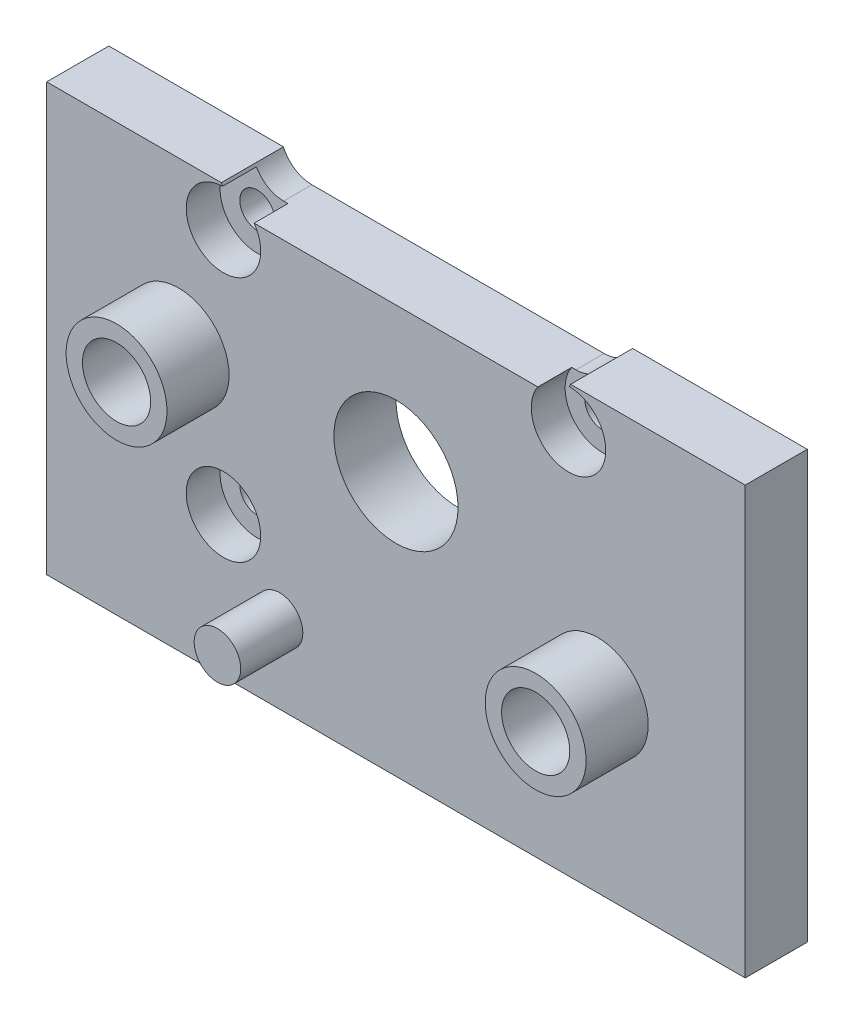
ISO-10303-21;
HEADER;
FILE_DESCRIPTION(('STEP AP214'),'2;1');
FILE_NAME('part.step','',(''),(''),'','','');
FILE_SCHEMA(('AUTOMOTIVE_DESIGN { 1 0 10303 214 1 1 1 1 }'));
ENDSEC;
DATA;
#1=APPLICATION_CONTEXT('core data for automotive mechanical design processes');
#2=APPLICATION_PROTOCOL_DEFINITION('international standard','automotive_design',2000,#1);
#3=PRODUCT_CONTEXT('',#1,'mechanical');
#4=PRODUCT('Part','Part','',(#3));
#5=PRODUCT_RELATED_PRODUCT_CATEGORY('part','',(#4));
#6=PRODUCT_DEFINITION_FORMATION('','',#4);
#7=PRODUCT_DEFINITION_CONTEXT('part definition',#1,'design');
#8=PRODUCT_DEFINITION('design','',#6,#7);
#9=PRODUCT_DEFINITION_SHAPE('','',#8);
#10=(LENGTH_UNIT() NAMED_UNIT(*) SI_UNIT(.MILLI.,.METRE.));
#11=(NAMED_UNIT(*) PLANE_ANGLE_UNIT() SI_UNIT($,.RADIAN.));
#12=(NAMED_UNIT(*) SI_UNIT($,.STERADIAN.) SOLID_ANGLE_UNIT());
#13=UNCERTAINTY_MEASURE_WITH_UNIT(LENGTH_MEASURE(1.E-05),#10,'distance_accuracy_value','');
#14=(GEOMETRIC_REPRESENTATION_CONTEXT(3) GLOBAL_UNCERTAINTY_ASSIGNED_CONTEXT((#13)) GLOBAL_UNIT_ASSIGNED_CONTEXT((#10,
#11,#12)) REPRESENTATION_CONTEXT('',''));
#15=CARTESIAN_POINT('',(0.,0.,0.));
#16=DIRECTION('',(0.,0.,1.));
#17=DIRECTION('',(1.,0.,0.));
#18=AXIS2_PLACEMENT_3D('',#15,#16,#17);
#19=CARTESIAN_POINT('',(22.5,10.5,0.));
#20=DIRECTION('',(0.,1.,0.));
#21=DIRECTION('',(0.,0.,1.));
#22=AXIS2_PLACEMENT_3D('',#19,#20,#21);
#23=PLANE('',#22);
#24=DIRECTION('',(0.,0.,-1.));
#25=VECTOR('',#24,1.);
#26=CARTESIAN_POINT('',(11.25,10.5,4.));
#27=LINE('',#26,#25);
#28=CARTESIAN_POINT('',(11.25,10.5,4.));
#29=VERTEX_POINT('',#28);
#30=CARTESIAN_POINT('',(11.25,10.5,0.));
#31=VERTEX_POINT('',#30);
#32=EDGE_CURVE('E148',#29,#31,#27,.T.);
#33=ORIENTED_EDGE('',*,*,#32,.F.);
#34=DIRECTION('',(-1.,0.,0.));
#35=VECTOR('',#34,1.);
#36=CARTESIAN_POINT('',(22.5,10.5,4.));
#37=LINE('',#36,#35);
#38=CARTESIAN_POINT('',(22.5,10.5,4.));
#39=VERTEX_POINT('',#38);
#40=EDGE_CURVE('E173',#39,#29,#37,.T.);
#41=ORIENTED_EDGE('',*,*,#40,.F.);
#42=DIRECTION('',(0.,0.,1.));
#43=VECTOR('',#42,1.);
#44=CARTESIAN_POINT('',(22.5,10.5,0.));
#45=LINE('',#44,#43);
#46=CARTESIAN_POINT('',(22.5,10.5,0.));
#47=VERTEX_POINT('',#46);
#48=EDGE_CURVE('E168',#47,#39,#45,.T.);
#49=ORIENTED_EDGE('',*,*,#48,.F.);
#50=DIRECTION('',(-1.,0.,0.));
#51=VECTOR('',#50,1.);
#52=CARTESIAN_POINT('',(22.5,10.5,0.));
#53=LINE('',#52,#51);
#54=EDGE_CURVE('E159',#47,#31,#53,.T.);
#55=ORIENTED_EDGE('',*,*,#54,.T.);
#56=EDGE_LOOP('',(#33,#41,#49,#55));
#57=FACE_BOUND('',#56,.T.);
#58=ADVANCED_FACE('F35',(#57),#23,.T.);
#59=CARTESIAN_POINT('',(22.5,-17.,0.));
#60=DIRECTION('',(1.,0.,0.));
#61=DIRECTION('',(0.,0.,-1.));
#62=AXIS2_PLACEMENT_3D('',#59,#60,#61);
#63=PLANE('',#62);
#64=DIRECTION('',(0.,1.,0.));
#65=VECTOR('',#64,1.);
#66=CARTESIAN_POINT('',(22.5,-17.,4.));
#67=LINE('',#66,#65);
#68=CARTESIAN_POINT('',(22.5,-17.,4.));
#69=VERTEX_POINT('',#68);
#70=EDGE_CURVE('E169',#69,#39,#67,.T.);
#71=ORIENTED_EDGE('',*,*,#70,.F.);
#72=DIRECTION('',(0.,0.,1.));
#73=VECTOR('',#72,1.);
#74=CARTESIAN_POINT('',(22.5,-17.,0.));
#75=LINE('',#74,#73);
#76=CARTESIAN_POINT('',(22.5,-17.,0.));
#77=VERTEX_POINT('',#76);
#78=EDGE_CURVE('E181',#77,#69,#75,.T.);
#79=ORIENTED_EDGE('',*,*,#78,.F.);
#80=DIRECTION('',(0.,1.,0.));
#81=VECTOR('',#80,1.);
#82=CARTESIAN_POINT('',(22.5,-17.,0.));
#83=LINE('',#82,#81);
#84=EDGE_CURVE('E154',#77,#47,#83,.T.);
#85=ORIENTED_EDGE('',*,*,#84,.T.);
#86=ORIENTED_EDGE('',*,*,#48,.T.);
#87=EDGE_LOOP('',(#71,#79,#85,#86));
#88=FACE_BOUND('',#87,.T.);
#89=ADVANCED_FACE('F37',(#88),#63,.T.);
#90=CARTESIAN_POINT('',(-22.5,-17.,0.));
#91=DIRECTION('',(0.,-1.,0.));
#92=DIRECTION('',(0.,0.,-1.));
#93=AXIS2_PLACEMENT_3D('',#90,#91,#92);
#94=PLANE('',#93);
#95=DIRECTION('',(1.,0.,0.));
#96=VECTOR('',#95,1.);
#97=CARTESIAN_POINT('',(-22.5,-17.,4.));
#98=LINE('',#97,#96);
#99=CARTESIAN_POINT('',(-22.5,-17.,4.));
#100=VERTEX_POINT('',#99);
#101=EDGE_CURVE('E158',#100,#69,#98,.T.);
#102=ORIENTED_EDGE('',*,*,#101,.F.);
#103=DIRECTION('',(0.,0.,1.));
#104=VECTOR('',#103,1.);
#105=CARTESIAN_POINT('',(-22.5,-17.,0.));
#106=LINE('',#105,#104);
#107=CARTESIAN_POINT('',(-22.5,-17.,0.));
#108=VERTEX_POINT('',#107);
#109=EDGE_CURVE('E184',#108,#100,#106,.T.);
#110=ORIENTED_EDGE('',*,*,#109,.F.);
#111=DIRECTION('',(1.,0.,0.));
#112=VECTOR('',#111,1.);
#113=CARTESIAN_POINT('',(-22.5,-17.,0.));
#114=LINE('',#113,#112);
#115=EDGE_CURVE('E165',#108,#77,#114,.T.);
#116=ORIENTED_EDGE('',*,*,#115,.T.);
#117=ORIENTED_EDGE('',*,*,#78,.T.);
#118=EDGE_LOOP('',(#102,#110,#116,#117));
#119=FACE_BOUND('',#118,.T.);
#120=ADVANCED_FACE('F316',(#119),#94,.T.);
#121=CARTESIAN_POINT('',(-22.5,10.5,0.));
#122=DIRECTION('',(-1.,0.,0.));
#123=DIRECTION('',(0.,0.,1.));
#124=AXIS2_PLACEMENT_3D('',#121,#122,#123);
#125=PLANE('',#124);
#126=DIRECTION('',(0.,-1.,0.));
#127=VECTOR('',#126,1.);
#128=CARTESIAN_POINT('',(-22.5,10.5,4.));
#129=LINE('',#128,#127);
#130=CARTESIAN_POINT('',(-22.5,10.5,4.));
#131=VERTEX_POINT('',#130);
#132=EDGE_CURVE('E176',#131,#100,#129,.T.);
#133=ORIENTED_EDGE('',*,*,#132,.F.);
#134=DIRECTION('',(0.,0.,1.));
#135=VECTOR('',#134,1.);
#136=CARTESIAN_POINT('',(-22.5,10.5,0.));
#137=LINE('',#136,#135);
#138=CARTESIAN_POINT('',(-22.5,10.5,0.));
#139=VERTEX_POINT('',#138);
#140=EDGE_CURVE('E186',#139,#131,#137,.T.);
#141=ORIENTED_EDGE('',*,*,#140,.F.);
#142=DIRECTION('',(0.,-1.,0.));
#143=VECTOR('',#142,1.);
#144=CARTESIAN_POINT('',(-22.5,10.5,0.));
#145=LINE('',#144,#143);
#146=EDGE_CURVE('E162',#139,#108,#145,.T.);
#147=ORIENTED_EDGE('',*,*,#146,.T.);
#148=ORIENTED_EDGE('',*,*,#109,.T.);
#149=EDGE_LOOP('',(#133,#141,#147,#148));
#150=FACE_BOUND('',#149,.T.);
#151=ADVANCED_FACE('F320',(#150),#125,.T.);
#152=DIRECTION('',(0.,0.,-1.));
#153=VECTOR('',#152,1.);
#154=CARTESIAN_POINT('',(-11.25,10.5,4.));
#155=LINE('',#154,#153);
#156=CARTESIAN_POINT('',(-11.25,10.5,4.));
#157=VERTEX_POINT('',#156);
#158=CARTESIAN_POINT('',(-11.25,10.5,0.));
#159=VERTEX_POINT('',#158);
#160=EDGE_CURVE('E144',#157,#159,#155,.T.);
#161=ORIENTED_EDGE('',*,*,#160,.T.);
#162=EDGE_CURVE('E157',#159,#139,#53,.T.);
#163=ORIENTED_EDGE('',*,*,#162,.T.);
#164=ORIENTED_EDGE('',*,*,#140,.T.);
#165=EDGE_CURVE('E172',#157,#131,#37,.T.);
#166=ORIENTED_EDGE('',*,*,#165,.F.);
#167=EDGE_LOOP('',(#161,#163,#164,#166));
#168=FACE_BOUND('',#167,.T.);
#169=ADVANCED_FACE('F312',(#168),#23,.T.);
#170=CARTESIAN_POINT('',(0.,0.,0.));
#171=DIRECTION('',(0.,0.,1.));
#172=DIRECTION('',(1.,0.,0.));
#173=AXIS2_PLACEMENT_3D('',#170,#171,#172);
#174=PLANE('',#173);
#175=CARTESIAN_POINT('',(-14.,0.,0.));
#176=DIRECTION('',(0.,0.,1.));
#177=DIRECTION('',(1.,0.,0.));
#178=AXIS2_PLACEMENT_3D('',#175,#176,#177);
#179=CIRCLE('',#178,2.1971);
#180=CARTESIAN_POINT('',(-11.8029,0.,0.));
#181=VERTEX_POINT('',#180);
#182=EDGE_CURVE('E282',#181,#181,#179,.T.);
#183=ORIENTED_EDGE('',*,*,#182,.T.);
#184=EDGE_LOOP('',(#183));
#185=FACE_BOUND('',#184,.T.);
#186=CARTESIAN_POINT('',(13.,-6.,0.));
#187=DIRECTION('',(0.,0.,1.));
#188=DIRECTION('',(1.,0.,0.));
#189=AXIS2_PLACEMENT_3D('',#186,#187,#188);
#190=CIRCLE('',#189,2.1971);
#191=CARTESIAN_POINT('',(15.1971,-6.,0.));
#192=VERTEX_POINT('',#191);
#193=EDGE_CURVE('E276',#192,#192,#190,.T.);
#194=ORIENTED_EDGE('',*,*,#193,.T.);
#195=EDGE_LOOP('',(#194));
#196=FACE_BOUND('',#195,.T.);
#197=CARTESIAN_POINT('',(-11.113,-7.942,0.));
#198=DIRECTION('',(0.,0.,1.));
#199=DIRECTION('',(1.,0.,0.));
#200=AXIS2_PLACEMENT_3D('',#197,#198,#199);
#201=CIRCLE('',#200,1.13000000000001);
#202=CARTESIAN_POINT('',(-9.98299999999999,-7.942,0.));
#203=VERTEX_POINT('',#202);
#204=EDGE_CURVE('E264',#203,#203,#201,.T.);
#205=ORIENTED_EDGE('',*,*,#204,.T.);
#206=EDGE_LOOP('',(#205));
#207=FACE_BOUND('',#206,.T.);
#208=CARTESIAN_POINT('',(-11.113,7.938,0.));
#209=DIRECTION('',(0.,0.,1.));
#210=DIRECTION('',(1.,0.,0.));
#211=AXIS2_PLACEMENT_3D('',#208,#209,#210);
#212=CIRCLE('',#211,1.13000000000001);
#213=CARTESIAN_POINT('',(-9.98299999999999,7.938,0.));
#214=VERTEX_POINT('',#213);
#215=EDGE_CURVE('E258',#214,#214,#212,.T.);
#216=ORIENTED_EDGE('',*,*,#215,.T.);
#217=EDGE_LOOP('',(#216));
#218=FACE_BOUND('',#217,.T.);
#219=CARTESIAN_POINT('',(11.117,7.938,0.));
#220=DIRECTION('',(0.,0.,1.));
#221=DIRECTION('',(1.,0.,0.));
#222=AXIS2_PLACEMENT_3D('',#219,#220,#221);
#223=CIRCLE('',#222,1.13000000000001);
#224=CARTESIAN_POINT('',(12.247,7.938,0.));
#225=VERTEX_POINT('',#224);
#226=EDGE_CURVE('E246',#225,#225,#223,.T.);
#227=ORIENTED_EDGE('',*,*,#226,.T.);
#228=EDGE_LOOP('',(#227));
#229=FACE_BOUND('',#228,.T.);
#230=CARTESIAN_POINT('',(0.,0.,0.));
#231=DIRECTION('',(0.,0.,-1.));
#232=DIRECTION('',(-1.,0.,0.));
#233=AXIS2_PLACEMENT_3D('',#230,#231,#232);
#234=CIRCLE('',#233,3.99999999999999);
#235=CARTESIAN_POINT('',(-3.99999999999999,0.,0.));
#236=VERTEX_POINT('',#235);
#237=EDGE_CURVE('E203',#236,#236,#234,.T.);
#238=ORIENTED_EDGE('',*,*,#237,.F.);
#239=EDGE_LOOP('',(#238));
#240=FACE_BOUND('',#239,.T.);
#241=DIRECTION('',(-1.,0.,0.));
#242=VECTOR('',#241,1.);
#243=CARTESIAN_POINT('',(9.41696972201767,9.3,0.));
#244=LINE('',#243,#242);
#245=CARTESIAN_POINT('',(9.41696972201767,9.3,0.));
#246=VERTEX_POINT('',#245);
#247=CARTESIAN_POINT('',(-9.41696972201767,9.3,0.));
#248=VERTEX_POINT('',#247);
#249=EDGE_CURVE('E141',#246,#248,#244,.T.);
#250=ORIENTED_EDGE('',*,*,#249,.F.);
#251=CARTESIAN_POINT('',(9.41696972201767,11.3,0.));
#252=DIRECTION('',(0.,0.,-1.));
#253=DIRECTION('',(-1.,0.,0.));
#254=AXIS2_PLACEMENT_3D('',#251,#252,#253);
#255=CIRCLE('',#254,2.);
#256=EDGE_CURVE('E216',#31,#246,#255,.T.);
#257=ORIENTED_EDGE('',*,*,#256,.F.);
#258=ORIENTED_EDGE('',*,*,#54,.F.);
#259=ORIENTED_EDGE('',*,*,#84,.F.);
#260=ORIENTED_EDGE('',*,*,#115,.F.);
#261=ORIENTED_EDGE('',*,*,#146,.F.);
#262=ORIENTED_EDGE('',*,*,#162,.F.);
#263=CARTESIAN_POINT('',(-9.41696972201767,11.3,0.));
#264=DIRECTION('',(0.,0.,-1.));
#265=DIRECTION('',(-1.,0.,0.));
#266=AXIS2_PLACEMENT_3D('',#263,#264,#265);
#267=CIRCLE('',#266,2.);
#268=EDGE_CURVE('E224',#248,#159,#267,.T.);
#269=ORIENTED_EDGE('',*,*,#268,.F.);
#270=EDGE_LOOP('',(#250,#257,#258,#259,#260,#261,#262,#269));
#271=FACE_BOUND('',#270,.T.);
#272=ADVANCED_FACE('F222',(#185,#196,#207,#218,#229,#240,#271),#174,.F.);
#273=CARTESIAN_POINT('',(0.,0.,4.));
#274=DIRECTION('',(0.,0.,1.));
#275=DIRECTION('',(1.,0.,0.));
#276=AXIS2_PLACEMENT_3D('',#273,#274,#275);
#277=PLANE('',#276);
#278=CARTESIAN_POINT('',(-11.113,-7.942,4.));
#279=DIRECTION('',(0.,0.,1.));
#280=DIRECTION('',(1.,0.,0.));
#281=AXIS2_PLACEMENT_3D('',#278,#279,#280);
#282=CIRCLE('',#281,2.4);
#283=CARTESIAN_POINT('',(-8.713,-7.942,4.));
#284=VERTEX_POINT('',#283);
#285=EDGE_CURVE('E273',#284,#284,#282,.T.);
#286=ORIENTED_EDGE('',*,*,#285,.F.);
#287=EDGE_LOOP('',(#286));
#288=FACE_BOUND('',#287,.T.);
#289=CARTESIAN_POINT('',(-11.113,7.938,4.));
#290=DIRECTION('',(0.,0.,1.));
#291=DIRECTION('',(1.,0.,0.));
#292=AXIS2_PLACEMENT_3D('',#289,#290,#291);
#293=CIRCLE('',#292,2.4);
#294=CARTESIAN_POINT('',(-11.1700388233723,10.3373221068936,4.));
#295=VERTEX_POINT('',#294);
#296=CARTESIAN_POINT('',(-9.1369038484932,9.3,4.));
#297=VERTEX_POINT('',#296);
#298=EDGE_CURVE('E50',#295,#297,#293,.T.);
#299=ORIENTED_EDGE('',*,*,#298,.F.);
#300=CARTESIAN_POINT('',(-9.41696972201767,11.3,4.));
#301=DIRECTION('',(0.,0.,-1.));
#302=DIRECTION('',(-1.,0.,0.));
#303=AXIS2_PLACEMENT_3D('',#300,#301,#302);
#304=CIRCLE('',#303,2.);
#305=EDGE_CURVE('E150',#295,#157,#304,.T.);
#306=ORIENTED_EDGE('',*,*,#305,.T.);
#307=ORIENTED_EDGE('',*,*,#165,.T.);
#308=ORIENTED_EDGE('',*,*,#132,.T.);
#309=ORIENTED_EDGE('',*,*,#101,.T.);
#310=ORIENTED_EDGE('',*,*,#70,.T.);
#311=ORIENTED_EDGE('',*,*,#40,.T.);
#312=CARTESIAN_POINT('',(9.41696972201767,11.3,4.));
#313=DIRECTION('',(0.,0.,-1.));
#314=DIRECTION('',(-1.,0.,0.));
#315=AXIS2_PLACEMENT_3D('',#312,#313,#314);
#316=CIRCLE('',#315,2.);
#317=CARTESIAN_POINT('',(11.1700886022937,10.3374127615536,4.));
#318=VERTEX_POINT('',#317);
#319=EDGE_CURVE('E226',#29,#318,#316,.T.);
#320=ORIENTED_EDGE('',*,*,#319,.T.);
#321=CARTESIAN_POINT('',(11.117,7.938,4.));
#322=DIRECTION('',(0.,0.,1.));
#323=DIRECTION('',(1.,0.,0.));
#324=AXIS2_PLACEMENT_3D('',#321,#322,#323);
#325=CIRCLE('',#324,2.4);
#326=CARTESIAN_POINT('',(9.1409038484932,9.3,4.));
#327=VERTEX_POINT('',#326);
#328=EDGE_CURVE('E253',#327,#318,#325,.T.);
#329=ORIENTED_EDGE('',*,*,#328,.F.);
#330=DIRECTION('',(-1.,0.,0.));
#331=VECTOR('',#330,1.);
#332=CARTESIAN_POINT('',(9.41696972201767,9.3,4.));
#333=LINE('',#332,#331);
#334=EDGE_CURVE('E230',#327,#297,#333,.T.);
#335=ORIENTED_EDGE('',*,*,#334,.T.);
#336=EDGE_LOOP('',(#299,#306,#307,#308,#309,#310,#311,#320,#329,#335));
#337=FACE_BOUND('',#336,.T.);
#338=CARTESIAN_POINT('',(0.,0.,4.));
#339=DIRECTION('',(0.,0.,1.));
#340=DIRECTION('',(1.,0.,0.));
#341=AXIS2_PLACEMENT_3D('',#338,#339,#340);
#342=CIRCLE('',#341,3.99999999999999);
#343=CARTESIAN_POINT('',(3.99999999999999,0.,4.));
#344=VERTEX_POINT('',#343);
#345=EDGE_CURVE('E199',#344,#344,#342,.T.);
#346=ORIENTED_EDGE('',*,*,#345,.F.);
#347=EDGE_LOOP('',(#346));
#348=FACE_BOUND('',#347,.T.);
#349=CARTESIAN_POINT('',(-14.,0.,4.));
#350=DIRECTION('',(0.,0.,1.));
#351=DIRECTION('',(1.,0.,0.));
#352=AXIS2_PLACEMENT_3D('',#349,#350,#351);
#353=CIRCLE('',#352,3.25);
#354=CARTESIAN_POINT('',(-10.75,0.,4.));
#355=VERTEX_POINT('',#354);
#356=EDGE_CURVE('E195',#355,#355,#353,.T.);
#357=ORIENTED_EDGE('',*,*,#356,.F.);
#358=EDGE_LOOP('',(#357));
#359=FACE_BOUND('',#358,.T.);
#360=CARTESIAN_POINT('',(-7.5,-12.,4.));
#361=DIRECTION('',(0.,0.,1.));
#362=DIRECTION('',(1.,0.,0.));
#363=AXIS2_PLACEMENT_3D('',#360,#361,#362);
#364=CIRCLE('',#363,1.5);
#365=CARTESIAN_POINT('',(-6.,-12.,4.));
#366=VERTEX_POINT('',#365);
#367=EDGE_CURVE('E192',#366,#366,#364,.T.);
#368=ORIENTED_EDGE('',*,*,#367,.F.);
#369=EDGE_LOOP('',(#368));
#370=FACE_BOUND('',#369,.T.);
#371=CARTESIAN_POINT('',(13.,-6.,4.));
#372=DIRECTION('',(0.,0.,1.));
#373=DIRECTION('',(1.,0.,0.));
#374=AXIS2_PLACEMENT_3D('',#371,#372,#373);
#375=CIRCLE('',#374,3.25);
#376=CARTESIAN_POINT('',(16.25,-6.,4.));
#377=VERTEX_POINT('',#376);
#378=EDGE_CURVE('E183',#377,#377,#375,.T.);
#379=ORIENTED_EDGE('',*,*,#378,.F.);
#380=EDGE_LOOP('',(#379));
#381=FACE_BOUND('',#380,.T.);
#382=ADVANCED_FACE('F326',(#288,#337,#348,#359,#370,#381),#277,.T.);
#383=CARTESIAN_POINT('',(9.41696972201767,11.3,4.));
#384=DIRECTION('',(0.,0.,-1.));
#385=DIRECTION('',(-1.,0.,0.));
#386=AXIS2_PLACEMENT_3D('',#383,#384,#385);
#387=CYLINDRICAL_SURFACE('',#386,2.);
#388=DIRECTION('',(0.,0.,-1.));
#389=VECTOR('',#388,1.);
#390=CARTESIAN_POINT('',(9.41696972201767,9.3,4.));
#391=LINE('',#390,#389);
#392=CARTESIAN_POINT('',(9.41696972201767,9.3,1.82));
#393=VERTEX_POINT('',#392);
#394=EDGE_CURVE('E145',#393,#246,#391,.T.);
#395=ORIENTED_EDGE('',*,*,#394,.F.);
#396=CARTESIAN_POINT('',(9.41696972201767,11.3,1.82));
#397=DIRECTION('',(0.,0.,-1.));
#398=DIRECTION('',(-1.,0.,0.));
#399=AXIS2_PLACEMENT_3D('',#396,#397,#398);
#400=CIRCLE('',#399,2.);
#401=CARTESIAN_POINT('',(11.1700886022937,10.3374127615536,1.82));
#402=VERTEX_POINT('',#401);
#403=EDGE_CURVE('E214',#393,#402,#400,.F.);
#404=ORIENTED_EDGE('',*,*,#403,.T.);
#405=DIRECTION('',(0.,0.,1.));
#406=VECTOR('',#405,1.);
#407=CARTESIAN_POINT('',(11.1700886022937,10.3374127615536,2.91));
#408=LINE('',#407,#406);
#409=EDGE_CURVE('E244',#402,#318,#408,.T.);
#410=ORIENTED_EDGE('',*,*,#409,.T.);
#411=ORIENTED_EDGE('',*,*,#319,.F.);
#412=ORIENTED_EDGE('',*,*,#32,.T.);
#413=ORIENTED_EDGE('',*,*,#256,.T.);
#414=EDGE_LOOP('',(#395,#404,#410,#411,#412,#413));
#415=FACE_BOUND('',#414,.T.);
#416=ADVANCED_FACE('F212',(#415),#387,.F.);
#417=CARTESIAN_POINT('',(-9.41696972201767,11.3,4.));
#418=DIRECTION('',(0.,0.,-1.));
#419=DIRECTION('',(-1.,0.,0.));
#420=AXIS2_PLACEMENT_3D('',#417,#418,#419);
#421=CYLINDRICAL_SURFACE('',#420,2.);
#422=DIRECTION('',(0.,0.,1.));
#423=VECTOR('',#422,1.);
#424=CARTESIAN_POINT('',(-11.1700388233723,10.3373221068936,2.91));
#425=LINE('',#424,#423);
#426=CARTESIAN_POINT('',(-11.1700388233723,10.3373221068936,1.82));
#427=VERTEX_POINT('',#426);
#428=EDGE_CURVE('E256',#295,#427,#425,.F.);
#429=ORIENTED_EDGE('',*,*,#428,.T.);
#430=CARTESIAN_POINT('',(-9.41696972201767,11.3,1.82));
#431=DIRECTION('',(0.,0.,-1.));
#432=DIRECTION('',(-1.,0.,0.));
#433=AXIS2_PLACEMENT_3D('',#430,#431,#432);
#434=CIRCLE('',#433,2.);
#435=CARTESIAN_POINT('',(-9.41696972201767,9.3,1.82));
#436=VERTEX_POINT('',#435);
#437=EDGE_CURVE('E133',#427,#436,#434,.F.);
#438=ORIENTED_EDGE('',*,*,#437,.T.);
#439=DIRECTION('',(0.,0.,-1.));
#440=VECTOR('',#439,1.);
#441=CARTESIAN_POINT('',(-9.41696972201767,9.3,4.));
#442=LINE('',#441,#440);
#443=EDGE_CURVE('E139',#436,#248,#442,.T.);
#444=ORIENTED_EDGE('',*,*,#443,.T.);
#445=ORIENTED_EDGE('',*,*,#268,.T.);
#446=ORIENTED_EDGE('',*,*,#160,.F.);
#447=ORIENTED_EDGE('',*,*,#305,.F.);
#448=EDGE_LOOP('',(#429,#438,#444,#445,#446,#447));
#449=FACE_BOUND('',#448,.T.);
#450=ADVANCED_FACE('F468',(#449),#421,.F.);
#451=CARTESIAN_POINT('',(9.41696972201767,9.3,4.));
#452=DIRECTION('',(0.,-1.,0.));
#453=DIRECTION('',(0.,0.,-1.));
#454=AXIS2_PLACEMENT_3D('',#451,#452,#453);
#455=PLANE('',#454);
#456=ORIENTED_EDGE('',*,*,#443,.F.);
#457=DIRECTION('',(1.,0.,0.));
#458=VECTOR('',#457,1.);
#459=CARTESIAN_POINT('',(9.41696972201767,9.3,1.82));
#460=LINE('',#459,#458);
#461=CARTESIAN_POINT('',(-9.1369038484932,9.3,1.82));
#462=VERTEX_POINT('',#461);
#463=EDGE_CURVE('E11',#436,#462,#460,.T.);
#464=ORIENTED_EDGE('',*,*,#463,.T.);
#465=DIRECTION('',(0.,0.,1.));
#466=VECTOR('',#465,1.);
#467=CARTESIAN_POINT('',(-9.1369038484932,9.3,4.));
#468=LINE('',#467,#466);
#469=EDGE_CURVE('E43',#462,#297,#468,.T.);
#470=ORIENTED_EDGE('',*,*,#469,.T.);
#471=ORIENTED_EDGE('',*,*,#334,.F.);
#472=DIRECTION('',(0.,0.,1.));
#473=VECTOR('',#472,1.);
#474=CARTESIAN_POINT('',(9.1409038484932,9.3,4.));
#475=LINE('',#474,#473);
#476=CARTESIAN_POINT('',(9.1409038484932,9.3,1.82));
#477=VERTEX_POINT('',#476);
#478=EDGE_CURVE('E198',#327,#477,#475,.F.);
#479=ORIENTED_EDGE('',*,*,#478,.T.);
#480=DIRECTION('',(1.,0.,0.));
#481=VECTOR('',#480,1.);
#482=CARTESIAN_POINT('',(9.41696972201767,9.3,1.82));
#483=LINE('',#482,#481);
#484=EDGE_CURVE('E129',#477,#393,#483,.T.);
#485=ORIENTED_EDGE('',*,*,#484,.T.);
#486=ORIENTED_EDGE('',*,*,#394,.T.);
#487=ORIENTED_EDGE('',*,*,#249,.T.);
#488=EDGE_LOOP('',(#456,#464,#470,#471,#479,#485,#486,#487));
#489=FACE_BOUND('',#488,.T.);
#490=ADVANCED_FACE('F137',(#489),#455,.F.);
#491=CARTESIAN_POINT('',(13.,-6.,4.));
#492=DIRECTION('',(0.,0.,1.));
#493=DIRECTION('',(1.,0.,0.));
#494=AXIS2_PLACEMENT_3D('',#491,#492,#493);
#495=CYLINDRICAL_SURFACE('',#494,3.25);
#496=ORIENTED_EDGE('',*,*,#378,.T.);
#497=EDGE_LOOP('',(#496));
#498=FACE_BOUND('',#497,.T.);
#499=CARTESIAN_POINT('',(13.,-6.,8.));
#500=DIRECTION('',(0.,0.,1.));
#501=DIRECTION('',(1.,0.,0.));
#502=AXIS2_PLACEMENT_3D('',#499,#500,#501);
#503=CIRCLE('',#502,3.25);
#504=CARTESIAN_POINT('',(16.25,-6.,8.));
#505=VERTEX_POINT('',#504);
#506=EDGE_CURVE('E220',#505,#505,#503,.T.);
#507=ORIENTED_EDGE('',*,*,#506,.F.);
#508=EDGE_LOOP('',(#507));
#509=FACE_BOUND('',#508,.T.);
#510=ADVANCED_FACE('F467',(#498,#509),#495,.T.);
#511=CARTESIAN_POINT('',(13.,-6.,8.));
#512=DIRECTION('',(0.,0.,1.));
#513=DIRECTION('',(1.,0.,0.));
#514=AXIS2_PLACEMENT_3D('',#511,#512,#513);
#515=PLANE('',#514);
#516=CARTESIAN_POINT('',(13.,-6.,8.));
#517=DIRECTION('',(0.,0.,1.));
#518=DIRECTION('',(1.,0.,0.));
#519=AXIS2_PLACEMENT_3D('',#516,#517,#518);
#520=CIRCLE('',#519,2.1971);
#521=CARTESIAN_POINT('',(15.1971,-6.,8.));
#522=VERTEX_POINT('',#521);
#523=EDGE_CURVE('E279',#522,#522,#520,.T.);
#524=ORIENTED_EDGE('',*,*,#523,.F.);
#525=EDGE_LOOP('',(#524));
#526=FACE_BOUND('',#525,.T.);
#527=ORIENTED_EDGE('',*,*,#506,.T.);
#528=EDGE_LOOP('',(#527));
#529=FACE_BOUND('',#528,.T.);
#530=ADVANCED_FACE('F522',(#526,#529),#515,.T.);
#531=CARTESIAN_POINT('',(-7.5,-12.,4.));
#532=DIRECTION('',(0.,0.,1.));
#533=DIRECTION('',(1.,0.,0.));
#534=AXIS2_PLACEMENT_3D('',#531,#532,#533);
#535=CYLINDRICAL_SURFACE('',#534,1.5);
#536=ORIENTED_EDGE('',*,*,#367,.T.);
#537=EDGE_LOOP('',(#536));
#538=FACE_BOUND('',#537,.T.);
#539=CARTESIAN_POINT('',(-7.5,-12.,8.));
#540=DIRECTION('',(0.,0.,1.));
#541=DIRECTION('',(1.,0.,0.));
#542=AXIS2_PLACEMENT_3D('',#539,#540,#541);
#543=CIRCLE('',#542,1.5);
#544=CARTESIAN_POINT('',(-6.,-12.,8.));
#545=VERTEX_POINT('',#544);
#546=EDGE_CURVE('E236',#545,#545,#543,.T.);
#547=ORIENTED_EDGE('',*,*,#546,.F.);
#548=EDGE_LOOP('',(#547));
#549=FACE_BOUND('',#548,.T.);
#550=ADVANCED_FACE('F307',(#538,#549),#535,.T.);
#551=CARTESIAN_POINT('',(-7.5,-12.,8.));
#552=DIRECTION('',(0.,0.,1.));
#553=DIRECTION('',(1.,0.,0.));
#554=AXIS2_PLACEMENT_3D('',#551,#552,#553);
#555=PLANE('',#554);
#556=ORIENTED_EDGE('',*,*,#546,.T.);
#557=EDGE_LOOP('',(#556));
#558=FACE_BOUND('',#557,.T.);
#559=ADVANCED_FACE('F301',(#558),#555,.T.);
#560=CARTESIAN_POINT('',(-14.,0.,4.));
#561=DIRECTION('',(0.,0.,1.));
#562=DIRECTION('',(1.,0.,0.));
#563=AXIS2_PLACEMENT_3D('',#560,#561,#562);
#564=CYLINDRICAL_SURFACE('',#563,3.25);
#565=ORIENTED_EDGE('',*,*,#356,.T.);
#566=EDGE_LOOP('',(#565));
#567=FACE_BOUND('',#566,.T.);
#568=CARTESIAN_POINT('',(-14.,0.,8.));
#569=DIRECTION('',(0.,0.,1.));
#570=DIRECTION('',(1.,0.,0.));
#571=AXIS2_PLACEMENT_3D('',#568,#569,#570);
#572=CIRCLE('',#571,3.25);
#573=CARTESIAN_POINT('',(-10.75,0.,8.));
#574=VERTEX_POINT('',#573);
#575=EDGE_CURVE('E202',#574,#574,#572,.T.);
#576=ORIENTED_EDGE('',*,*,#575,.F.);
#577=EDGE_LOOP('',(#576));
#578=FACE_BOUND('',#577,.T.);
#579=ADVANCED_FACE('F296',(#567,#578),#564,.T.);
#580=CARTESIAN_POINT('',(-14.,0.,8.));
#581=DIRECTION('',(0.,0.,1.));
#582=DIRECTION('',(1.,0.,0.));
#583=AXIS2_PLACEMENT_3D('',#580,#581,#582);
#584=PLANE('',#583);
#585=CARTESIAN_POINT('',(-14.,0.,8.));
#586=DIRECTION('',(0.,0.,1.));
#587=DIRECTION('',(1.,0.,0.));
#588=AXIS2_PLACEMENT_3D('',#585,#586,#587);
#589=CIRCLE('',#588,2.1971);
#590=CARTESIAN_POINT('',(-11.8029,0.,8.));
#591=VERTEX_POINT('',#590);
#592=EDGE_CURVE('E285',#591,#591,#589,.T.);
#593=ORIENTED_EDGE('',*,*,#592,.F.);
#594=EDGE_LOOP('',(#593));
#595=FACE_BOUND('',#594,.T.);
#596=ORIENTED_EDGE('',*,*,#575,.T.);
#597=EDGE_LOOP('',(#596));
#598=FACE_BOUND('',#597,.T.);
#599=ADVANCED_FACE('F292',(#595,#598),#584,.T.);
#600=CARTESIAN_POINT('',(0.,0.,0.));
#601=DIRECTION('',(0.,0.,-1.));
#602=DIRECTION('',(-1.,0.,0.));
#603=AXIS2_PLACEMENT_3D('',#600,#601,#602);
#604=CYLINDRICAL_SURFACE('',#603,3.99999999999999);
#605=ORIENTED_EDGE('',*,*,#345,.T.);
#606=EDGE_LOOP('',(#605));
#607=FACE_BOUND('',#606,.T.);
#608=ORIENTED_EDGE('',*,*,#237,.T.);
#609=EDGE_LOOP('',(#608));
#610=FACE_BOUND('',#609,.T.);
#611=ADVANCED_FACE('F295',(#607,#610),#604,.F.);
#612=CARTESIAN_POINT('',(12.247,7.938,1.82));
#613=DIRECTION('',(0.,0.,-1.));
#614=DIRECTION('',(-1.,0.,0.));
#615=AXIS2_PLACEMENT_3D('',#612,#613,#614);
#616=PLANE('',#615);
#617=CARTESIAN_POINT('',(11.117,7.938,1.82));
#618=DIRECTION('',(0.,0.,1.));
#619=DIRECTION('',(1.,0.,0.));
#620=AXIS2_PLACEMENT_3D('',#617,#618,#619);
#621=CIRCLE('',#620,1.13000000000001);
#622=CARTESIAN_POINT('',(12.247,7.938,1.82));
#623=VERTEX_POINT('',#622);
#624=EDGE_CURVE('E249',#623,#623,#621,.T.);
#625=ORIENTED_EDGE('',*,*,#624,.F.);
#626=EDGE_LOOP('',(#625));
#627=FACE_BOUND('',#626,.T.);
#628=ORIENTED_EDGE('',*,*,#484,.F.);
#629=CARTESIAN_POINT('',(11.117,7.938,1.82));
#630=DIRECTION('',(0.,0.,1.));
#631=DIRECTION('',(1.,0.,0.));
#632=AXIS2_PLACEMENT_3D('',#629,#630,#631);
#633=CIRCLE('',#632,2.4);
#634=EDGE_CURVE('E58',#477,#402,#633,.T.);
#635=ORIENTED_EDGE('',*,*,#634,.T.);
#636=ORIENTED_EDGE('',*,*,#403,.F.);
#637=EDGE_LOOP('',(#628,#635,#636));
#638=FACE_BOUND('',#637,.T.);
#639=ADVANCED_FACE('F346',(#627,#638),#616,.F.);
#640=CARTESIAN_POINT('',(11.117,7.938,4.));
#641=DIRECTION('',(0.,0.,1.));
#642=DIRECTION('',(1.,0.,0.));
#643=AXIS2_PLACEMENT_3D('',#640,#641,#642);
#644=CYLINDRICAL_SURFACE('',#643,2.4);
#645=ORIENTED_EDGE('',*,*,#634,.F.);
#646=ORIENTED_EDGE('',*,*,#478,.F.);
#647=ORIENTED_EDGE('',*,*,#328,.T.);
#648=ORIENTED_EDGE('',*,*,#409,.F.);
#649=EDGE_LOOP('',(#645,#646,#647,#648));
#650=FACE_BOUND('',#649,.T.);
#651=ADVANCED_FACE('F345',(#650),#644,.F.);
#652=CARTESIAN_POINT('',(11.117,7.938,4.));
#653=DIRECTION('',(0.,0.,1.));
#654=DIRECTION('',(1.,0.,0.));
#655=AXIS2_PLACEMENT_3D('',#652,#653,#654);
#656=CYLINDRICAL_SURFACE('',#655,1.13000000000001);
#657=ORIENTED_EDGE('',*,*,#226,.F.);
#658=EDGE_LOOP('',(#657));
#659=FACE_BOUND('',#658,.T.);
#660=ORIENTED_EDGE('',*,*,#624,.T.);
#661=EDGE_LOOP('',(#660));
#662=FACE_BOUND('',#661,.T.);
#663=ADVANCED_FACE('F354',(#659,#662),#656,.F.);
#664=CARTESIAN_POINT('',(-9.98299999999999,7.938,1.82));
#665=DIRECTION('',(0.,0.,-1.));
#666=DIRECTION('',(-1.,0.,0.));
#667=AXIS2_PLACEMENT_3D('',#664,#665,#666);
#668=PLANE('',#667);
#669=CARTESIAN_POINT('',(-11.113,7.938,1.82));
#670=DIRECTION('',(0.,0.,1.));
#671=DIRECTION('',(1.,0.,0.));
#672=AXIS2_PLACEMENT_3D('',#669,#670,#671);
#673=CIRCLE('',#672,1.13000000000001);
#674=CARTESIAN_POINT('',(-9.98299999999999,7.938,1.82));
#675=VERTEX_POINT('',#674);
#676=EDGE_CURVE('E134',#675,#675,#673,.T.);
#677=ORIENTED_EDGE('',*,*,#676,.F.);
#678=EDGE_LOOP('',(#677));
#679=FACE_BOUND('',#678,.T.);
#680=CARTESIAN_POINT('',(-11.113,7.938,1.82));
#681=DIRECTION('',(0.,0.,1.));
#682=DIRECTION('',(1.,0.,0.));
#683=AXIS2_PLACEMENT_3D('',#680,#681,#682);
#684=CIRCLE('',#683,2.4);
#685=EDGE_CURVE('E124',#427,#462,#684,.T.);
#686=ORIENTED_EDGE('',*,*,#685,.T.);
#687=ORIENTED_EDGE('',*,*,#463,.F.);
#688=ORIENTED_EDGE('',*,*,#437,.F.);
#689=EDGE_LOOP('',(#686,#687,#688));
#690=FACE_BOUND('',#689,.T.);
#691=ADVANCED_FACE('F131',(#679,#690),#668,.F.);
#692=CARTESIAN_POINT('',(-11.113,7.938,4.));
#693=DIRECTION('',(0.,0.,1.));
#694=DIRECTION('',(1.,0.,0.));
#695=AXIS2_PLACEMENT_3D('',#692,#693,#694);
#696=CYLINDRICAL_SURFACE('',#695,2.4);
#697=ORIENTED_EDGE('',*,*,#298,.T.);
#698=ORIENTED_EDGE('',*,*,#469,.F.);
#699=ORIENTED_EDGE('',*,*,#685,.F.);
#700=ORIENTED_EDGE('',*,*,#428,.F.);
#701=EDGE_LOOP('',(#697,#698,#699,#700));
#702=FACE_BOUND('',#701,.T.);
#703=ADVANCED_FACE('F123',(#702),#696,.F.);
#704=CARTESIAN_POINT('',(-11.113,7.938,4.));
#705=DIRECTION('',(0.,0.,1.));
#706=DIRECTION('',(1.,0.,0.));
#707=AXIS2_PLACEMENT_3D('',#704,#705,#706);
#708=CYLINDRICAL_SURFACE('',#707,1.13000000000001);
#709=ORIENTED_EDGE('',*,*,#215,.F.);
#710=EDGE_LOOP('',(#709));
#711=FACE_BOUND('',#710,.T.);
#712=ORIENTED_EDGE('',*,*,#676,.T.);
#713=EDGE_LOOP('',(#712));
#714=FACE_BOUND('',#713,.T.);
#715=ADVANCED_FACE('F377',(#711,#714),#708,.F.);
#716=CARTESIAN_POINT('',(-11.113,-7.942,4.));
#717=DIRECTION('',(0.,0.,1.));
#718=DIRECTION('',(1.,0.,0.));
#719=AXIS2_PLACEMENT_3D('',#716,#717,#718);
#720=CYLINDRICAL_SURFACE('',#719,1.13000000000001);
#721=ORIENTED_EDGE('',*,*,#204,.F.);
#722=EDGE_LOOP('',(#721));
#723=FACE_BOUND('',#722,.T.);
#724=CARTESIAN_POINT('',(-11.113,-7.942,1.82));
#725=DIRECTION('',(0.,0.,1.));
#726=DIRECTION('',(1.,0.,0.));
#727=AXIS2_PLACEMENT_3D('',#724,#725,#726);
#728=CIRCLE('',#727,1.13000000000001);
#729=CARTESIAN_POINT('',(-9.98299999999999,-7.942,1.82));
#730=VERTEX_POINT('',#729);
#731=EDGE_CURVE('E267',#730,#730,#728,.T.);
#732=ORIENTED_EDGE('',*,*,#731,.T.);
#733=EDGE_LOOP('',(#732));
#734=FACE_BOUND('',#733,.T.);
#735=ADVANCED_FACE('F382',(#723,#734),#720,.F.);
#736=CARTESIAN_POINT('',(-9.98299999999999,-7.942,1.82));
#737=DIRECTION('',(0.,0.,-1.));
#738=DIRECTION('',(-1.,0.,0.));
#739=AXIS2_PLACEMENT_3D('',#736,#737,#738);
#740=PLANE('',#739);
#741=ORIENTED_EDGE('',*,*,#731,.F.);
#742=EDGE_LOOP('',(#741));
#743=FACE_BOUND('',#742,.T.);
#744=CARTESIAN_POINT('',(-11.113,-7.942,1.82));
#745=DIRECTION('',(0.,0.,1.));
#746=DIRECTION('',(1.,0.,0.));
#747=AXIS2_PLACEMENT_3D('',#744,#745,#746);
#748=CIRCLE('',#747,2.4);
#749=CARTESIAN_POINT('',(-8.713,-7.942,1.82));
#750=VERTEX_POINT('',#749);
#751=EDGE_CURVE('E270',#750,#750,#748,.T.);
#752=ORIENTED_EDGE('',*,*,#751,.T.);
#753=EDGE_LOOP('',(#752));
#754=FACE_BOUND('',#753,.T.);
#755=ADVANCED_FACE('F387',(#743,#754),#740,.F.);
#756=CARTESIAN_POINT('',(-11.113,-7.942,4.));
#757=DIRECTION('',(0.,0.,1.));
#758=DIRECTION('',(1.,0.,0.));
#759=AXIS2_PLACEMENT_3D('',#756,#757,#758);
#760=CYLINDRICAL_SURFACE('',#759,2.4);
#761=ORIENTED_EDGE('',*,*,#751,.F.);
#762=EDGE_LOOP('',(#761));
#763=FACE_BOUND('',#762,.T.);
#764=ORIENTED_EDGE('',*,*,#285,.T.);
#765=EDGE_LOOP('',(#764));
#766=FACE_BOUND('',#765,.T.);
#767=ADVANCED_FACE('F395',(#763,#766),#760,.F.);
#768=CARTESIAN_POINT('',(13.,-6.,8.));
#769=DIRECTION('',(0.,0.,1.));
#770=DIRECTION('',(1.,0.,0.));
#771=AXIS2_PLACEMENT_3D('',#768,#769,#770);
#772=CYLINDRICAL_SURFACE('',#771,2.1971);
#773=ORIENTED_EDGE('',*,*,#523,.T.);
#774=EDGE_LOOP('',(#773));
#775=FACE_BOUND('',#774,.T.);
#776=ORIENTED_EDGE('',*,*,#193,.F.);
#777=EDGE_LOOP('',(#776));
#778=FACE_BOUND('',#777,.T.);
#779=ADVANCED_FACE('F403',(#775,#778),#772,.F.);
#780=CARTESIAN_POINT('',(-14.,0.,8.));
#781=DIRECTION('',(0.,0.,1.));
#782=DIRECTION('',(1.,0.,0.));
#783=AXIS2_PLACEMENT_3D('',#780,#781,#782);
#784=CYLINDRICAL_SURFACE('',#783,2.1971);
#785=ORIENTED_EDGE('',*,*,#592,.T.);
#786=EDGE_LOOP('',(#785));
#787=FACE_BOUND('',#786,.T.);
#788=ORIENTED_EDGE('',*,*,#182,.F.);
#789=EDGE_LOOP('',(#788));
#790=FACE_BOUND('',#789,.T.);
#791=ADVANCED_FACE('F289',(#787,#790),#784,.F.);
#792=CLOSED_SHELL('',(#58,#89,#120,#151,#169,#272,#382,#416,#450,#490,#510,#530,#550,#559,#579,
#599,#611,#639,#651,#663,#691,#703,#715,#735,#755,#767,#779,#791));
#793=MANIFOLD_SOLID_BREP('B2',#792);
#794=ADVANCED_BREP_SHAPE_REPRESENTATION('',(#18,#793),#14);
#795=SHAPE_DEFINITION_REPRESENTATION(#9,#794);
ENDSEC;
END-ISO-10303-21;
